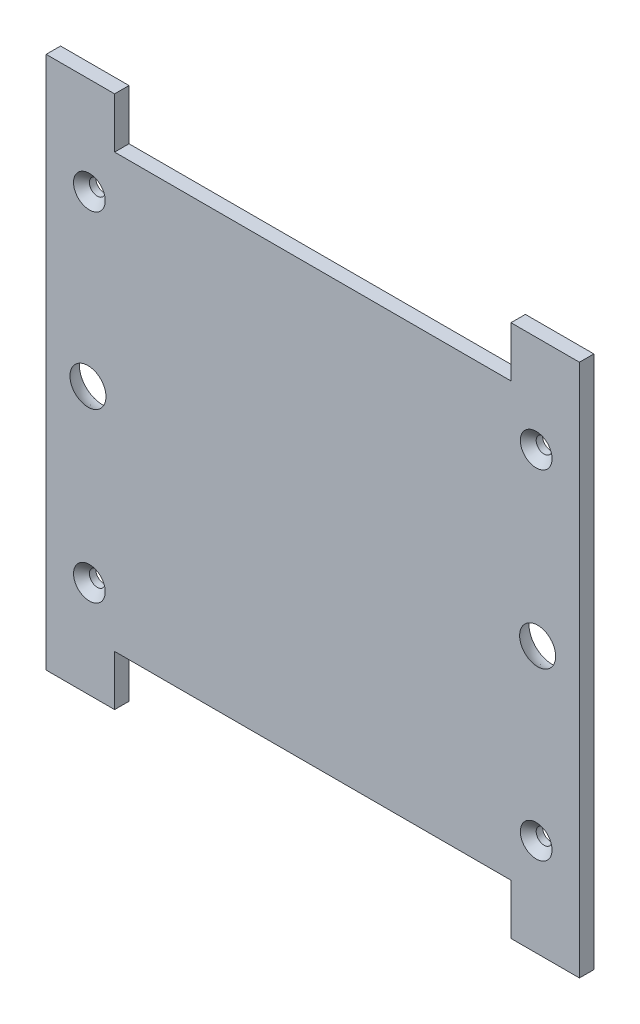
ISO-10303-21;
HEADER;
FILE_DESCRIPTION(('STEP AP214'),'2;1');
FILE_NAME('part.step','',(''),(''),'','','');
FILE_SCHEMA(('AUTOMOTIVE_DESIGN { 1 0 10303 214 1 1 1 1 }'));
ENDSEC;
DATA;
#1=APPLICATION_CONTEXT('core data for automotive mechanical design processes');
#2=APPLICATION_PROTOCOL_DEFINITION('international standard','automotive_design',2000,#1);
#3=PRODUCT_CONTEXT('',#1,'mechanical');
#4=PRODUCT('Part','Part','',(#3));
#5=PRODUCT_RELATED_PRODUCT_CATEGORY('part','',(#4));
#6=PRODUCT_DEFINITION_FORMATION('','',#4);
#7=PRODUCT_DEFINITION_CONTEXT('part definition',#1,'design');
#8=PRODUCT_DEFINITION('design','',#6,#7);
#9=PRODUCT_DEFINITION_SHAPE('','',#8);
#10=(LENGTH_UNIT() NAMED_UNIT(*) SI_UNIT(.MILLI.,.METRE.));
#11=(NAMED_UNIT(*) PLANE_ANGLE_UNIT() SI_UNIT($,.RADIAN.));
#12=(NAMED_UNIT(*) SI_UNIT($,.STERADIAN.) SOLID_ANGLE_UNIT());
#13=UNCERTAINTY_MEASURE_WITH_UNIT(LENGTH_MEASURE(1.E-05),#10,'distance_accuracy_value','');
#14=(GEOMETRIC_REPRESENTATION_CONTEXT(3) GLOBAL_UNCERTAINTY_ASSIGNED_CONTEXT((#13)) GLOBAL_UNIT_ASSIGNED_CONTEXT((#10,
#11,#12)) REPRESENTATION_CONTEXT('',''));
#15=CARTESIAN_POINT('',(0.,0.,0.));
#16=DIRECTION('',(0.,0.,1.));
#17=DIRECTION('',(1.,0.,0.));
#18=AXIS2_PLACEMENT_3D('',#15,#16,#17);
#19=CARTESIAN_POINT('',(0.,37.,0.));
#20=DIRECTION('',(0.,-1.,0.));
#21=DIRECTION('',(0.,0.,-1.));
#22=AXIS2_PLACEMENT_3D('',#19,#20,#21);
#23=PLANE('',#22);
#24=DIRECTION('',(-1.,0.,0.));
#25=VECTOR('',#24,1.);
#26=CARTESIAN_POINT('',(-37.,37.,0.));
#27=LINE('',#26,#25);
#28=CARTESIAN_POINT('',(37.,37.,0.));
#29=VERTEX_POINT('',#28);
#30=CARTESIAN_POINT('',(27.500000007,37.,0.));
#31=VERTEX_POINT('',#30);
#32=EDGE_CURVE('E165',#29,#31,#27,.T.);
#33=ORIENTED_EDGE('',*,*,#32,.T.);
#34=DIRECTION('',(0.,0.,1.));
#35=VECTOR('',#34,1.);
#36=CARTESIAN_POINT('',(27.500000007,37.,0.));
#37=LINE('',#36,#35);
#38=CARTESIAN_POINT('',(27.500000007,37.,2.));
#39=VERTEX_POINT('',#38);
#40=EDGE_CURVE('E148',#31,#39,#37,.T.);
#41=ORIENTED_EDGE('',*,*,#40,.T.);
#42=DIRECTION('',(1.,0.,0.));
#43=VECTOR('',#42,1.);
#44=CARTESIAN_POINT('',(34.4,37.,2.));
#45=LINE('',#44,#43);
#46=CARTESIAN_POINT('',(37.,37.,2.));
#47=VERTEX_POINT('',#46);
#48=EDGE_CURVE('E177',#39,#47,#45,.T.);
#49=ORIENTED_EDGE('',*,*,#48,.T.);
#50=DIRECTION('',(0.,0.,1.));
#51=VECTOR('',#50,1.);
#52=CARTESIAN_POINT('',(37.,37.,2.));
#53=LINE('',#52,#51);
#54=EDGE_CURVE('E172',#29,#47,#53,.T.);
#55=ORIENTED_EDGE('',*,*,#54,.F.);
#56=EDGE_LOOP('',(#33,#41,#49,#55));
#57=FACE_BOUND('',#56,.T.);
#58=ADVANCED_FACE('F42',(#57),#23,.F.);
#59=CARTESIAN_POINT('',(0.,-37.,0.));
#60=DIRECTION('',(0.,1.,0.));
#61=DIRECTION('',(0.,0.,1.));
#62=AXIS2_PLACEMENT_3D('',#59,#60,#61);
#63=PLANE('',#62);
#64=DIRECTION('',(1.,0.,0.));
#65=VECTOR('',#64,1.);
#66=CARTESIAN_POINT('',(34.4,-37.,0.));
#67=LINE('',#66,#65);
#68=CARTESIAN_POINT('',(-37.,-37.,0.));
#69=VERTEX_POINT('',#68);
#70=CARTESIAN_POINT('',(-27.500000007,-37.,0.));
#71=VERTEX_POINT('',#70);
#72=EDGE_CURVE('E179',#69,#71,#67,.T.);
#73=ORIENTED_EDGE('',*,*,#72,.T.);
#74=DIRECTION('',(0.,0.,1.));
#75=VECTOR('',#74,1.);
#76=CARTESIAN_POINT('',(-27.500000007,-37.,0.));
#77=LINE('',#76,#75);
#78=CARTESIAN_POINT('',(-27.500000007,-37.,2.));
#79=VERTEX_POINT('',#78);
#80=EDGE_CURVE('E474',#71,#79,#77,.T.);
#81=ORIENTED_EDGE('',*,*,#80,.T.);
#82=DIRECTION('',(-1.,0.,0.));
#83=VECTOR('',#82,1.);
#84=CARTESIAN_POINT('',(-37.,-37.,2.));
#85=LINE('',#84,#83);
#86=CARTESIAN_POINT('',(-37.,-37.,2.));
#87=VERTEX_POINT('',#86);
#88=EDGE_CURVE('E498',#79,#87,#85,.T.);
#89=ORIENTED_EDGE('',*,*,#88,.T.);
#90=DIRECTION('',(0.,0.,-1.));
#91=VECTOR('',#90,1.);
#92=CARTESIAN_POINT('',(-37.,-37.,0.));
#93=LINE('',#92,#91);
#94=EDGE_CURVE('E501',#87,#69,#93,.T.);
#95=ORIENTED_EDGE('',*,*,#94,.T.);
#96=EDGE_LOOP('',(#73,#81,#89,#95));
#97=FACE_BOUND('',#96,.T.);
#98=ADVANCED_FACE('F420',(#97),#63,.F.);
#99=CARTESIAN_POINT('',(-37.,-37.,0.));
#100=DIRECTION('',(0.,0.,1.));
#101=DIRECTION('',(1.,0.,0.));
#102=AXIS2_PLACEMENT_3D('',#99,#100,#101);
#103=PLANE('',#102);
#104=CARTESIAN_POINT('',(-31.,-23.5,0.));
#105=DIRECTION('',(0.,0.,1.));
#106=DIRECTION('',(1.,0.,0.));
#107=AXIS2_PLACEMENT_3D('',#104,#105,#106);
#108=CIRCLE('',#107,1.09999999999999);
#109=CARTESIAN_POINT('',(-29.9,-23.5,0.));
#110=VERTEX_POINT('',#109);
#111=EDGE_CURVE('E581',#110,#110,#108,.T.);
#112=ORIENTED_EDGE('',*,*,#111,.T.);
#113=EDGE_LOOP('',(#112));
#114=FACE_BOUND('',#113,.T.);
#115=CARTESIAN_POINT('',(31.,-23.5,0.));
#116=DIRECTION('',(0.,0.,1.));
#117=DIRECTION('',(1.,0.,0.));
#118=AXIS2_PLACEMENT_3D('',#115,#116,#117);
#119=CIRCLE('',#118,1.09999999999999);
#120=CARTESIAN_POINT('',(32.1,-23.5,0.));
#121=VERTEX_POINT('',#120);
#122=EDGE_CURVE('E592',#121,#121,#119,.T.);
#123=ORIENTED_EDGE('',*,*,#122,.T.);
#124=EDGE_LOOP('',(#123));
#125=FACE_BOUND('',#124,.T.);
#126=CARTESIAN_POINT('',(31.,23.5,0.));
#127=DIRECTION('',(0.,0.,1.));
#128=DIRECTION('',(1.,0.,0.));
#129=AXIS2_PLACEMENT_3D('',#126,#127,#128);
#130=CIRCLE('',#129,1.09999999999999);
#131=CARTESIAN_POINT('',(32.1,23.5,0.));
#132=VERTEX_POINT('',#131);
#133=EDGE_CURVE('E601',#132,#132,#130,.T.);
#134=ORIENTED_EDGE('',*,*,#133,.T.);
#135=EDGE_LOOP('',(#134));
#136=FACE_BOUND('',#135,.T.);
#137=CARTESIAN_POINT('',(-31.,23.5,0.));
#138=DIRECTION('',(0.,0.,1.));
#139=DIRECTION('',(1.,0.,0.));
#140=AXIS2_PLACEMENT_3D('',#137,#138,#139);
#141=CIRCLE('',#140,1.09999999999999);
#142=CARTESIAN_POINT('',(-29.9,23.5,0.));
#143=VERTEX_POINT('',#142);
#144=EDGE_CURVE('E456',#143,#143,#141,.T.);
#145=ORIENTED_EDGE('',*,*,#144,.T.);
#146=EDGE_LOOP('',(#145));
#147=FACE_BOUND('',#146,.T.);
#148=DIRECTION('',(1.,0.,0.));
#149=VECTOR('',#148,1.);
#150=CARTESIAN_POINT('',(-27.500000007,29.9999999925,0.));
#151=LINE('',#150,#149);
#152=CARTESIAN_POINT('',(-27.500000007,29.9999999925,0.));
#153=VERTEX_POINT('',#152);
#154=CARTESIAN_POINT('',(27.500000007,29.9999999925,0.));
#155=VERTEX_POINT('',#154);
#156=EDGE_CURVE('E159',#153,#155,#151,.T.);
#157=ORIENTED_EDGE('',*,*,#156,.T.);
#158=DIRECTION('',(0.,1.,0.));
#159=VECTOR('',#158,1.);
#160=CARTESIAN_POINT('',(27.500000007,29.9999999925,0.));
#161=LINE('',#160,#159);
#162=EDGE_CURVE('E151',#155,#31,#161,.T.);
#163=ORIENTED_EDGE('',*,*,#162,.T.);
#164=ORIENTED_EDGE('',*,*,#32,.F.);
#165=DIRECTION('',(0.,1.,0.));
#166=VECTOR('',#165,1.);
#167=CARTESIAN_POINT('',(37.,37.,0.));
#168=LINE('',#167,#166);
#169=CARTESIAN_POINT('',(37.,-37.,0.));
#170=VERTEX_POINT('',#169);
#171=EDGE_CURVE('E495',#170,#29,#168,.T.);
#172=ORIENTED_EDGE('',*,*,#171,.F.);
#173=CARTESIAN_POINT('',(27.500000007,-37.,0.));
#174=VERTEX_POINT('',#173);
#175=EDGE_CURVE('E503',#174,#170,#67,.T.);
#176=ORIENTED_EDGE('',*,*,#175,.F.);
#177=DIRECTION('',(0.,1.,0.));
#178=VECTOR('',#177,1.);
#179=CARTESIAN_POINT('',(27.500000007,-37.,0.));
#180=LINE('',#179,#178);
#181=CARTESIAN_POINT('',(27.500000007,-29.9999999925,0.));
#182=VERTEX_POINT('',#181);
#183=EDGE_CURVE('E70',#174,#182,#180,.T.);
#184=ORIENTED_EDGE('',*,*,#183,.T.);
#185=DIRECTION('',(-1.,0.,0.));
#186=VECTOR('',#185,1.);
#187=CARTESIAN_POINT('',(27.500000007,-29.9999999925,0.));
#188=LINE('',#187,#186);
#189=CARTESIAN_POINT('',(-27.500000007,-29.9999999925,0.));
#190=VERTEX_POINT('',#189);
#191=EDGE_CURVE('E471',#182,#190,#188,.T.);
#192=ORIENTED_EDGE('',*,*,#191,.T.);
#193=DIRECTION('',(0.,-1.,0.));
#194=VECTOR('',#193,1.);
#195=CARTESIAN_POINT('',(-27.500000007,-29.9999999925,0.));
#196=LINE('',#195,#194);
#197=EDGE_CURVE('E466',#190,#71,#196,.T.);
#198=ORIENTED_EDGE('',*,*,#197,.T.);
#199=ORIENTED_EDGE('',*,*,#72,.F.);
#200=DIRECTION('',(0.,-1.,0.));
#201=VECTOR('',#200,1.);
#202=CARTESIAN_POINT('',(-37.,-3.2,0.));
#203=LINE('',#202,#201);
#204=CARTESIAN_POINT('',(-37.,37.,0.));
#205=VERTEX_POINT('',#204);
#206=EDGE_CURVE('E186',#205,#69,#203,.T.);
#207=ORIENTED_EDGE('',*,*,#206,.F.);
#208=CARTESIAN_POINT('',(-27.500000007,37.,0.));
#209=VERTEX_POINT('',#208);
#210=EDGE_CURVE('E174',#209,#205,#27,.T.);
#211=ORIENTED_EDGE('',*,*,#210,.F.);
#212=DIRECTION('',(0.,-1.,0.));
#213=VECTOR('',#212,1.);
#214=CARTESIAN_POINT('',(-27.500000007,37.,0.));
#215=LINE('',#214,#213);
#216=EDGE_CURVE('E62',#209,#153,#215,.T.);
#217=ORIENTED_EDGE('',*,*,#216,.T.);
#218=EDGE_LOOP('',(#157,#163,#164,#172,#176,#184,#192,#198,#199,#207,#211,#217));
#219=FACE_BOUND('',#218,.T.);
#220=CARTESIAN_POINT('',(31.2,0.,0.));
#221=DIRECTION('',(0.,0.,1.));
#222=DIRECTION('',(-1.,0.,0.));
#223=AXIS2_PLACEMENT_3D('',#220,#221,#222);
#224=CIRCLE('',#223,3.2);
#225=CARTESIAN_POINT('',(28.,0.,0.));
#226=VERTEX_POINT('',#225);
#227=CARTESIAN_POINT('',(34.4,0.,0.));
#228=VERTEX_POINT('',#227);
#229=EDGE_CURVE('E233',#226,#228,#224,.T.);
#230=ORIENTED_EDGE('',*,*,#229,.T.);
#231=CARTESIAN_POINT('',(31.2,0.,0.));
#232=DIRECTION('',(0.,0.,-1.));
#233=DIRECTION('',(-1.,0.,0.));
#234=AXIS2_PLACEMENT_3D('',#231,#232,#233);
#235=CIRCLE('',#234,3.2);
#236=EDGE_CURVE('E236',#228,#226,#235,.F.);
#237=ORIENTED_EDGE('',*,*,#236,.T.);
#238=EDGE_LOOP('',(#230,#237));
#239=FACE_BOUND('',#238,.T.);
#240=CARTESIAN_POINT('',(-31.2,0.,0.));
#241=DIRECTION('',(0.,0.,1.));
#242=DIRECTION('',(-1.,0.,0.));
#243=AXIS2_PLACEMENT_3D('',#240,#241,#242);
#244=CIRCLE('',#243,3.2);
#245=CARTESIAN_POINT('',(-34.4,0.,0.));
#246=VERTEX_POINT('',#245);
#247=CARTESIAN_POINT('',(-28.,0.,0.));
#248=VERTEX_POINT('',#247);
#249=EDGE_CURVE('E47',#246,#248,#244,.T.);
#250=ORIENTED_EDGE('',*,*,#249,.T.);
#251=CARTESIAN_POINT('',(-31.2,0.,0.));
#252=DIRECTION('',(0.,0.,1.));
#253=DIRECTION('',(-1.,0.,0.));
#254=AXIS2_PLACEMENT_3D('',#251,#252,#253);
#255=CIRCLE('',#254,3.2);
#256=EDGE_CURVE('E237',#248,#246,#255,.T.);
#257=ORIENTED_EDGE('',*,*,#256,.T.);
#258=EDGE_LOOP('',(#250,#257));
#259=FACE_BOUND('',#258,.T.);
#260=ADVANCED_FACE('F162',(#114,#125,#136,#147,#219,#239,#259),#103,.F.);
#261=CARTESIAN_POINT('',(-31.2,0.,0.));
#262=DIRECTION('',(1.,0.,0.));
#263=DIRECTION('',(0.,-1.,0.));
#264=AXIS2_PLACEMENT_3D('',#261,#262,#263);
#265=SPHERICAL_SURFACE('',#264,3.2);
#266=ORIENTED_EDGE('',*,*,#249,.F.);
#267=ORIENTED_EDGE('',*,*,#256,.F.);
#268=EDGE_LOOP('',(#266,#267));
#269=FACE_BOUND('',#268,.T.);
#270=CARTESIAN_POINT('',(-28.7020008006406,-2.0509626842719E-10,2.));
#271=CARTESIAN_POINT('',(-28.7020012209484,-0.070135983993747,2.));
#272=CARTESIAN_POINT('',(-28.7049572392322,-0.140284857163702,2.));
#273=CARTESIAN_POINT('',(-28.7167620940701,-0.280097831874726,2.));
#274=CARTESIAN_POINT('',(-28.7256126703689,-0.349761784158728,2.));
#275=CARTESIAN_POINT('',(-28.7491668221806,-0.488213726424342,2.));
#276=CARTESIAN_POINT('',(-28.7638796886623,-0.557000146175289,2.));
#277=CARTESIAN_POINT('',(-28.7990570025474,-0.693127271670801,2.));
#278=CARTESIAN_POINT('',(-28.8195261173959,-0.760466756275641,2.));
#279=CARTESIAN_POINT('',(-28.8892848378274,-0.959305142461169,2.));
#280=CARTESIAN_POINT('',(-28.9469831180034,-1.08795860462085,2.));
#281=CARTESIAN_POINT('',(-29.0831904020595,-1.33373843161031,2.));
#282=CARTESIAN_POINT('',(-29.1617001970435,-1.45086435801405,2.));
#283=CARTESIAN_POINT('',(-29.293286161117,-1.61536285946238,2.));
#284=CARTESIAN_POINT('',(-29.3394864355108,-1.6683616161924,2.));
#285=CARTESIAN_POINT('',(-29.436151031562,-1.77024220587743,2.));
#286=CARTESIAN_POINT('',(-29.4866111990885,-1.8191279589001,2.));
#287=CARTESIAN_POINT('',(-29.5914945615326,-1.91249617316629,2.));
#288=CARTESIAN_POINT('',(-29.6459195413138,-1.95697662972413,2.));
#289=CARTESIAN_POINT('',(-29.7583182040915,-2.04119901892372,2.));
#290=CARTESIAN_POINT('',(-29.8162927060881,-2.08093985168362,2.));
#291=CARTESIAN_POINT('',(-29.9949083454022,-2.19258284669061,2.));
#292=CARTESIAN_POINT('',(-30.1203524575497,-2.25700399562119,2.00000000000001));
#293=CARTESIAN_POINT('',(-30.3802079569302,-2.36383242870174,1.99999999999999));
#294=CARTESIAN_POINT('',(-30.5146192483722,-2.40623994796758,1.99999999999997));
#295=CARTESIAN_POINT('',(-30.7886710059771,-2.46789871785615,1.99999999999997));
#296=CARTESIAN_POINT('',(-30.9283115000621,-2.48714984481392,1.99999999999999));
#297=CARTESIAN_POINT('',(-31.208842301376,-2.50192941652294,2.00000000000001));
#298=CARTESIAN_POINT('',(-31.349732608605,-2.49745786127418,1.99999999999999));
#299=CARTESIAN_POINT('',(-31.6287461574432,-2.46493695545636,1.99999999999999));
#300=CARTESIAN_POINT('',(-31.7668694138256,-2.43688773080164,2.));
#301=CARTESIAN_POINT('',(-32.0365115847101,-2.35795551714079,2.));
#302=CARTESIAN_POINT('',(-32.1680304286569,-2.30707228425498,1.99999999999999));
#303=CARTESIAN_POINT('',(-32.3573883753691,-2.21481572373656,1.99999999999999));
#304=CARTESIAN_POINT('',(-32.4192177819692,-2.18138667723981,2.));
#305=CARTESIAN_POINT('',(-32.5398440491683,-2.10944104569552,2.));
#306=CARTESIAN_POINT('',(-32.5986416086613,-2.07092564049903,2.));
#307=CARTESIAN_POINT('',(-32.7127551950701,-1.98909512938154,2.));
#308=CARTESIAN_POINT('',(-32.7680727863225,-1.94578220459652,2.));
#309=CARTESIAN_POINT('',(-32.8749075592384,-1.85462283875681,2.));
#310=CARTESIAN_POINT('',(-32.9264210216768,-1.80677206283211,2.));
#311=CARTESIAN_POINT('',(-33.0745635412537,-1.65701086354027,1.99999999999999));
#312=CARTESIAN_POINT('',(-33.1649459501064,-1.54878290636489,2.));
#313=CARTESIAN_POINT('',(-33.3262250014326,-1.318675941698,2.));
#314=CARTESIAN_POINT('',(-33.3971223845622,-1.19679745333226,2.));
#315=CARTESIAN_POINT('',(-33.4873882612442,-1.0063898526332,2.));
#316=CARTESIAN_POINT('',(-33.5148198896085,-0.941573985634305,2.));
#317=CARTESIAN_POINT('',(-33.5641062902884,-0.809896772662918,2.));
#318=CARTESIAN_POINT('',(-33.5859655758969,-0.743037131511001,2.));
#319=CARTESIAN_POINT('',(-33.6239374439416,-0.607826645150295,2.));
#320=CARTESIAN_POINT('',(-33.6400591009175,-0.539478337746316,2.));
#321=CARTESIAN_POINT('',(-33.6664897281663,-0.401679773027809,2.));
#322=CARTESIAN_POINT('',(-33.6768004128691,-0.332229846951155,2.));
#323=CARTESIAN_POINT('',(-33.688776426321,-0.218893566079055,2.));
#324=CARTESIAN_POINT('',(-33.6922338717323,-0.175188670686404,2.));
#325=CARTESIAN_POINT('',(-33.696845389583,-0.0876575282851449,2.));
#326=CARTESIAN_POINT('',(-33.6979994620223,-0.043831281276538,2.));
#327=CARTESIAN_POINT('',(-33.6979987790631,0.070135983583391,2.));
#328=CARTESIAN_POINT('',(-33.6950427607909,0.140284856753735,2.));
#329=CARTESIAN_POINT('',(-33.6832379059759,0.28009783146653,2.));
#330=CARTESIAN_POINT('',(-33.6743873296886,0.349761783751912,2.));
#331=CARTESIAN_POINT('',(-33.6508331778996,0.488213726021429,2.));
#332=CARTESIAN_POINT('',(-33.6361203114292,0.557000145774899,2.));
#333=CARTESIAN_POINT('',(-33.6009429975665,0.693127271276379,2.));
#334=CARTESIAN_POINT('',(-33.580473882729,0.760466755884665,2.));
#335=CARTESIAN_POINT('',(-33.5107151623301,0.959305142081725,2.));
#336=CARTESIAN_POINT('',(-33.4530168821753,1.08795860425088,2.));
#337=CARTESIAN_POINT('',(-33.3168095981596,1.33373843126271,2.));
#338=CARTESIAN_POINT('',(-33.2382998031948,1.45086435767934,2.));
#339=CARTESIAN_POINT('',(-33.1067138391482,1.61536285914927,2.));
#340=CARTESIAN_POINT('',(-33.0605135647632,1.66836161588688,2.));
#341=CARTESIAN_POINT('',(-32.9638489687287,1.77024220558777,2.));
#342=CARTESIAN_POINT('',(-32.9133888012102,1.81912795861872,2.));
#343=CARTESIAN_POINT('',(-32.8085054387815,1.91249617290214,2.));
#344=CARTESIAN_POINT('',(-32.7540804590075,1.95697662946892,2.));
#345=CARTESIAN_POINT('',(-32.6416817962437,2.04119901868698,2.));
#346=CARTESIAN_POINT('',(-32.5837072942536,2.0809398514564,2.));
#347=CARTESIAN_POINT('',(-32.4050916549578,2.19258284649273,2.));
#348=CARTESIAN_POINT('',(-32.2796475428209,2.2570039954439,2.00000000000001));
#349=CARTESIAN_POINT('',(-32.0197920434579,2.36383242856713,1.99999999999999));
#350=CARTESIAN_POINT('',(-31.8853807520229,2.40623994785503,1.99999999999997));
#351=CARTESIAN_POINT('',(-31.6113289944281,2.46789871778861,1.99999999999997));
#352=CARTESIAN_POINT('',(-31.4716885003464,2.48714984476931,1.99999999999999));
#353=CARTESIAN_POINT('',(-31.1911576990348,2.50192941652439,2.00000000000001));
#354=CARTESIAN_POINT('',(-31.0502673918051,2.49745786129877,1.99999999999999));
#355=CARTESIAN_POINT('',(-30.7712538429615,2.46493695552677,1.99999999999999));
#356=CARTESIAN_POINT('',(-30.6331305865746,2.43688773089472,2.));
#357=CARTESIAN_POINT('',(-30.3634884156771,2.35795551727816,2.));
#358=CARTESIAN_POINT('',(-30.2319695717219,2.30707228441393,1.99999999999999));
#359=CARTESIAN_POINT('',(-30.0426116249946,2.21481572392661,2.));
#360=CARTESIAN_POINT('',(-29.980782218389,2.18138667744002,2.));
#361=CARTESIAN_POINT('',(-29.8601559511781,2.10944104591554,2.));
#362=CARTESIAN_POINT('',(-29.8013583916788,2.07092564072871,2.));
#363=CARTESIAN_POINT('',(-29.6872448052565,1.98909512962996,2.));
#364=CARTESIAN_POINT('',(-29.6319272139971,1.94578220485402,2.));
#365=CARTESIAN_POINT('',(-29.5250924410661,1.85462283903184,2.));
#366=CARTESIAN_POINT('',(-29.4735789786198,1.80677206311561,2.));
#367=CARTESIAN_POINT('',(-29.3254364590184,1.6570108638481,1.99999999999999));
#368=CARTESIAN_POINT('',(-29.235054050148,1.54878290668756,2.));
#369=CARTESIAN_POINT('',(-29.0737749987839,1.31867594204715,2.));
#370=CARTESIAN_POINT('',(-29.0028776156344,1.19679745369305,2.));
#371=CARTESIAN_POINT('',(-28.9126117389211,1.00638985300888,2.));
#372=CARTESIAN_POINT('',(-28.8851801105462,0.941573986014578,2.));
#373=CARTESIAN_POINT('',(-28.8358937098447,0.809896773051471,2.));
#374=CARTESIAN_POINT('',(-28.8140344242252,0.743037131903249,2.));
#375=CARTESIAN_POINT('',(-28.7760625561583,0.607826645548818,2.));
#376=CARTESIAN_POINT('',(-28.7599408991712,0.539478338147416,2.));
#377=CARTESIAN_POINT('',(-28.7335102718997,0.401679773433086,2.));
#378=CARTESIAN_POINT('',(-28.7231995871854,0.33222984735803,2.));
#379=CARTESIAN_POINT('',(-28.7112235737005,0.218893566351757,2.));
#380=CARTESIAN_POINT('',(-28.7077661282749,0.175188670822944,2.));
#381=CARTESIAN_POINT('',(-28.7031546104099,0.0876575281486049,2.));
#382=CARTESIAN_POINT('',(-28.7020005379705,0.0438312810030793,2.));
#383=CARTESIAN_POINT('',(-28.7020008006406,-2.0509626842719E-10,2.));
#384=B_SPLINE_CURVE_WITH_KNOTS('',3,(#270,#271,#272,#273,#274,#275,#276,#277,#278,#279,#280,
#281,#282,#283,#284,#285,#286,#287,#288,#289,#290,#291,#292,#293,#294,#295,#296,#297,#298,#299,
#300,#301,#302,#303,#304,#305,#306,#307,#308,#309,#310,#311,#312,#313,#314,#315,#316,#317,#318,
#319,#320,#321,#322,#323,#324,#325,#326,#327,#328,#329,#330,#331,#332,#333,#334,#335,#336,#337,
#338,#339,#340,#341,#342,#343,#344,#345,#346,#347,#348,#349,#350,#351,#352,#353,#354,#355,#356,
#357,#358,#359,#360,#361,#362,#363,#364,#365,#366,#367,#368,#369,#370,#371,#372,#373,#374,#375,
#376,#377,#378,#379,#380,#381,#382,#383),.UNSPECIFIED.,.T.,.F.,(4,2,2,2,2,2,2,2,2,2,2,2,2,2,2,2,
2,2,2,2,2,2,2,2,2,2,2,2,2,2,2,2,2,2,2,2,2,2,2,2,2,2,2,2,2,2,2,2,2,2,2,2,2,2,2,2,4),(0.,
0.210367600517301,0.420797317340917,0.631561873011383,0.842497822016848,1.26336421327966,
1.68424660514718,1.89496355766447,2.1054773473023,2.3160864979215,2.52674442800266,
2.94762106719418,3.36849321113397,3.78936760269969,4.21024199426541,4.63111413820522,
5.05199077739674,5.26264870747792,5.47325785809713,5.68377164773495,5.89448860025222,
6.31537099211975,6.73623738338256,6.94717333238829,7.15793788805906,7.36836760488248,
7.57873520539941,7.71020383146715,7.8416724575349,8.05204005805182,8.26246977487524,
8.47323433054602,8.68417027955175,9.10503667081454,9.52591906268207,9.73663601519935,
9.94714980483716,10.1577589554564,10.3684168855376,10.7892935247291,11.2101656686689,
11.6310400602346,12.0519144518003,12.4727865957401,12.8936632349316,13.1043211650128,
13.314930315632,13.5254441052698,13.7361610577871,14.1570434496546,14.5779098409175,
14.7888457899229,14.9996103455934,15.210040062417,15.4204076629343,15.5518762894121,
15.6833449158899),.UNSPECIFIED.);
#385=CARTESIAN_POINT('',(-28.7020008006406,-2.0509626842719E-10,2.));
#386=VERTEX_POINT('',#385);
#387=EDGE_CURVE('E54',#386,#386,#384,.T.);
#388=ORIENTED_EDGE('',*,*,#387,.F.);
#389=EDGE_LOOP('',(#388));
#390=FACE_BOUND('',#389,.T.);
#391=ADVANCED_FACE('F199',(#269,#390),#265,.F.);
#392=CARTESIAN_POINT('',(31.2,0.,0.));
#393=DIRECTION('',(1.,0.,0.));
#394=DIRECTION('',(0.,1.,0.));
#395=AXIS2_PLACEMENT_3D('',#392,#393,#394);
#396=SPHERICAL_SURFACE('',#395,3.2);
#397=ORIENTED_EDGE('',*,*,#229,.F.);
#398=ORIENTED_EDGE('',*,*,#236,.F.);
#399=EDGE_LOOP('',(#397,#398));
#400=FACE_BOUND('',#399,.T.);
#401=CARTESIAN_POINT('',(33.6979991993594,3.84690109628272E-10,2.));
#402=CARTESIAN_POINT('',(33.6979987790681,-0.070135983403726,2.));
#403=CARTESIAN_POINT('',(33.695042760801,-0.140284856574241,2.));
#404=CARTESIAN_POINT('',(33.6832379059961,-0.28009783128781,2.));
#405=CARTESIAN_POINT('',(33.6743873297138,-0.349761783573797,2.));
#406=CARTESIAN_POINT('',(33.6508331779348,-0.488213725845023,2.));
#407=CARTESIAN_POINT('',(33.6361203114693,-0.557000145599597,2.));
#408=CARTESIAN_POINT('',(33.6009429976163,-0.693127271103689,2.));
#409=CARTESIAN_POINT('',(33.5804738827837,-0.760466755713485,2.));
#410=CARTESIAN_POINT('',(33.5107151623991,-0.959305141915595,2.));
#411=CARTESIAN_POINT('',(33.4530168822535,-1.08795860408889,2.));
#412=CARTESIAN_POINT('',(33.3168095982554,-1.33373843111052,2.));
#413=CARTESIAN_POINT('',(33.2382998032991,-1.4508643575328,2.));
#414=CARTESIAN_POINT('',(33.1067138392644,-1.61536285901219,2.));
#415=CARTESIAN_POINT('',(33.0605135648831,-1.66836161575312,2.));
#416=CARTESIAN_POINT('',(32.963848968856,-1.77024220546095,2.));
#417=CARTESIAN_POINT('',(32.913388801341,-1.81912795849554,2.));
#418=CARTESIAN_POINT('',(32.808505438919,-1.91249617278649,2.));
#419=CARTESIAN_POINT('',(32.7540804591482,-1.95697662935719,2.));
#420=CARTESIAN_POINT('',(32.6416817963905,-2.04119901858333,2.));
#421=CARTESIAN_POINT('',(32.5837072944032,-2.08093985135692,2.));
#422=CARTESIAN_POINT('',(32.4050916551154,-2.19258284640609,2.));
#423=CARTESIAN_POINT('',(32.2796475429831,-2.25700399536628,2.00000000000001));
#424=CARTESIAN_POINT('',(32.0197920436279,-2.36383242850819,1.99999999999999));
#425=CARTESIAN_POINT('',(31.8853807521959,-2.40623994780576,1.99999999999997));
#426=CARTESIAN_POINT('',(31.6113289946056,-2.46789871775903,1.99999999999997));
#427=CARTESIAN_POINT('',(31.4716885005252,-2.48714984474977,1.99999999999999));
#428=CARTESIAN_POINT('',(31.1911576992147,-2.50192941652502,2.00000000000001));
#429=CARTESIAN_POINT('',(31.0502673919846,-2.49745786130953,2.));
#430=CARTESIAN_POINT('',(30.7712538431388,-2.46493695555759,1.99999999999999));
#431=CARTESIAN_POINT('',(30.6331305867498,-2.43688773093548,2.));
#432=CARTESIAN_POINT('',(30.3634884158466,-2.3579555173383,2.));
#433=CARTESIAN_POINT('',(30.2319695718878,-2.30707228448353,1.99999999999999));
#434=CARTESIAN_POINT('',(30.0426116251539,-2.21481572400982,2.));
#435=CARTESIAN_POINT('',(29.9807822185458,-2.18138667752768,2.));
#436=CARTESIAN_POINT('',(29.8601559513298,-2.10944104601187,2.));
#437=CARTESIAN_POINT('',(29.8013583918277,-2.07092564082927,2.));
#438=CARTESIAN_POINT('',(29.6872448053995,-1.98909512973873,2.));
#439=CARTESIAN_POINT('',(29.631927214137,-1.94578220496676,2.));
#440=CARTESIAN_POINT('',(29.5250924411994,-1.85462283915226,2.));
#441=CARTESIAN_POINT('',(29.4735789787497,-1.80677206323973,2.));
#442=CARTESIAN_POINT('',(29.3254364591375,-1.65701086398287,1.99999999999999));
#443=CARTESIAN_POINT('',(29.2350540502593,-1.54878290682883,2.));
#444=CARTESIAN_POINT('',(29.0737749988787,-1.31867594220002,2.));
#445=CARTESIAN_POINT('',(29.0028776157204,-1.19679745385101,2.));
#446=CARTESIAN_POINT('',(28.9126117389935,-1.00638985317337,2.));
#447=CARTESIAN_POINT('',(28.8851801106139,-0.941573986181073,2.));
#448=CARTESIAN_POINT('',(28.835893709903,-0.809896773221591,2.));
#449=CARTESIAN_POINT('',(28.8140344242787,-0.743037132074985,2.));
#450=CARTESIAN_POINT('',(28.7760625562021,-0.607826645723302,2.));
#451=CARTESIAN_POINT('',(28.75994089921,-0.539478338323029,2.));
#452=CARTESIAN_POINT('',(28.7335102719286,-0.401679773610527,2.));
#453=CARTESIAN_POINT('',(28.7231995872093,-0.332229847536171,2.));
#454=CARTESIAN_POINT('',(28.71122357371,-0.218893566471153,2.));
#455=CARTESIAN_POINT('',(28.707766128278,-0.175188670882725,2.));
#456=CARTESIAN_POINT('',(28.7031546104067,-0.0876575280888241,2.));
#457=CARTESIAN_POINT('',(28.7020005379673,-0.0438312808833515,2.));
#458=CARTESIAN_POINT('',(28.7020012209535,0.0701359841734129,2.));
#459=CARTESIAN_POINT('',(28.7049572392423,0.140284857343197,2.));
#460=CARTESIAN_POINT('',(28.7167620940903,0.280097832053447,2.));
#461=CARTESIAN_POINT('',(28.7256126703941,0.349761784336844,2.));
#462=CARTESIAN_POINT('',(28.7491668222158,0.488213726600749,2.));
#463=CARTESIAN_POINT('',(28.7638796887024,0.557000146350592,2.));
#464=CARTESIAN_POINT('',(28.7990570025973,0.693127271843492,2.));
#465=CARTESIAN_POINT('',(28.8195261174506,0.760466756446823,2.));
#466=CARTESIAN_POINT('',(28.8892848378964,0.959305142627301,2.));
#467=CARTESIAN_POINT('',(28.9469831180816,1.08795860478284,2.));
#468=CARTESIAN_POINT('',(29.0831904021553,1.33373843176251,2.));
#469=CARTESIAN_POINT('',(29.1617001971478,1.45086435816059,2.));
#470=CARTESIAN_POINT('',(29.2932861612332,1.61536285959946,2.));
#471=CARTESIAN_POINT('',(29.3394864356308,1.66836161632617,2.));
#472=CARTESIAN_POINT('',(29.4361510316893,1.77024220600425,2.));
#473=CARTESIAN_POINT('',(29.4866111992193,1.81912795902329,2.));
#474=CARTESIAN_POINT('',(29.5914945616701,1.91249617328194,2.));
#475=CARTESIAN_POINT('',(29.6459195414545,1.95697662983587,2.));
#476=CARTESIAN_POINT('',(29.7583182042382,2.04119901902737,2.));
#477=CARTESIAN_POINT('',(29.8162927062377,2.08093985178311,2.));
#478=CARTESIAN_POINT('',(29.9949083455599,2.19258284677725,2.));
#479=CARTESIAN_POINT('',(30.120352457712,2.25700399569881,2.00000000000001));
#480=CARTESIAN_POINT('',(30.3802079571002,2.36383242876068,1.99999999999999));
#481=CARTESIAN_POINT('',(30.5146192485452,2.40623994801685,1.99999999999997));
#482=CARTESIAN_POINT('',(30.7886710061545,2.46789871788572,1.99999999999997));
#483=CARTESIAN_POINT('',(30.9283115002409,2.48714984483345,1.99999999999999));
#484=CARTESIAN_POINT('',(31.2088423015559,2.5019294165223,2.00000000000001));
#485=CARTESIAN_POINT('',(31.3497326087846,2.49745786126341,1.99999999999999));
#486=CARTESIAN_POINT('',(31.6287461576204,2.46493695542554,1.99999999999999));
#487=CARTESIAN_POINT('',(31.7668694140007,2.43688773076088,2.));
#488=CARTESIAN_POINT('',(32.0365115848796,2.35795551708065,2.));
#489=CARTESIAN_POINT('',(32.1680304288228,2.30707228418538,1.99999999999999));
#490=CARTESIAN_POINT('',(32.3573883755283,2.21481572365334,2.));
#491=CARTESIAN_POINT('',(32.419217782126,2.18138667715215,2.));
#492=CARTESIAN_POINT('',(32.5398440493199,2.10944104559918,2.));
#493=CARTESIAN_POINT('',(32.5986416088102,2.07092564039847,2.));
#494=CARTESIAN_POINT('',(32.7127551952131,1.98909512927277,2.));
#495=CARTESIAN_POINT('',(32.7680727864624,1.94578220448377,2.));
#496=CARTESIAN_POINT('',(32.8749075593718,1.85462283863638,2.));
#497=CARTESIAN_POINT('',(32.9264210218067,1.80677206270799,2.));
#498=CARTESIAN_POINT('',(33.0745635413728,1.6570108634055,1.99999999999999));
#499=CARTESIAN_POINT('',(33.1649459502177,1.54878290622362,2.));
#500=CARTESIAN_POINT('',(33.3262250015274,1.31867594154513,2.));
#501=CARTESIAN_POINT('',(33.3971223846482,1.19679745317429,2.));
#502=CARTESIAN_POINT('',(33.4873882613165,1.00638985246871,2.));
#503=CARTESIAN_POINT('',(33.5148198896763,0.941573985467811,2.));
#504=CARTESIAN_POINT('',(33.5641062903467,0.809896772492797,2.));
#505=CARTESIAN_POINT('',(33.5859655759504,0.743037131339261,2.));
#506=CARTESIAN_POINT('',(33.6239374439854,0.607826644975808,2.));
#507=CARTESIAN_POINT('',(33.6400591009563,0.539478337570702,2.));
#508=CARTESIAN_POINT('',(33.6664897281952,0.401679772850367,2.));
#509=CARTESIAN_POINT('',(33.676800412893,0.332229846773011,2.));
#510=CARTESIAN_POINT('',(33.6887764263305,0.218893565959657,2.));
#511=CARTESIAN_POINT('',(33.6922338717355,0.175188670626621,2.));
#512=CARTESIAN_POINT('',(33.6968453895798,0.0876575283449247,2.));
#513=CARTESIAN_POINT('',(33.6979994620192,0.0438312813962649,2.));
#514=CARTESIAN_POINT('',(33.6979991993594,3.84690109628272E-10,2.));
#515=B_SPLINE_CURVE_WITH_KNOTS('',3,(#401,#402,#403,#404,#405,#406,#407,#408,#409,#410,#411,
#412,#413,#414,#415,#416,#417,#418,#419,#420,#421,#422,#423,#424,#425,#426,#427,#428,#429,#430,
#431,#432,#433,#434,#435,#436,#437,#438,#439,#440,#441,#442,#443,#444,#445,#446,#447,#448,#449,
#450,#451,#452,#453,#454,#455,#456,#457,#458,#459,#460,#461,#462,#463,#464,#465,#466,#467,#468,
#469,#470,#471,#472,#473,#474,#475,#476,#477,#478,#479,#480,#481,#482,#483,#484,#485,#486,#487,
#488,#489,#490,#491,#492,#493,#494,#495,#496,#497,#498,#499,#500,#501,#502,#503,#504,#505,#506,
#507,#508,#509,#510,#511,#512,#513,#514),.UNSPECIFIED.,.T.,.F.,(4,2,2,2,2,2,2,2,2,2,2,2,2,2,2,2,
2,2,2,2,2,2,2,2,2,2,2,2,2,2,2,2,2,2,2,2,2,2,2,2,2,2,2,2,2,2,2,2,2,2,2,2,2,2,2,2,4),(0.,
0.210367600516765,0.420797317340091,0.631561873011003,0.84249782201685,1.26336421327964,
1.68424660514718,1.89496355766445,2.10547734730225,2.31608649792147,2.52674442800266,
2.9476210671942,3.36849321113398,3.78936760269969,4.21024199426541,4.63111413820522,
5.05199077739674,5.2626487074779,5.47325785809709,5.68377164773493,5.89448860025223,
6.31537099211974,6.73623738338255,6.9471733323879,7.15793788805823,7.36836760488194,
7.5787352053994,7.71020383205673,7.84167245871406,8.05204005923152,8.26246977605523,
8.47323433172556,8.68417028073091,9.10503667199373,9.52591906386124,9.73663601637853,
9.94714980601637,10.1577589566356,10.3684168867167,10.7892935259082,11.210165669848,
11.6310400614138,12.0519144529795,12.4727865969193,12.8936632361108,13.104321166192,
13.3149303168112,13.525444106449,13.7361610589663,14.1570434508338,14.5779098420966,
14.7888457911025,14.9996103467734,15.2100400635967,15.4204076641135,15.5518762900017,
15.6833449158899),.UNSPECIFIED.);
#516=CARTESIAN_POINT('',(33.6979991993594,3.84690109628272E-10,2.));
#517=VERTEX_POINT('',#516);
#518=EDGE_CURVE('E12',#517,#517,#515,.T.);
#519=ORIENTED_EDGE('',*,*,#518,.F.);
#520=EDGE_LOOP('',(#519));
#521=FACE_BOUND('',#520,.T.);
#522=ADVANCED_FACE('F194',(#400,#521),#396,.F.);
#523=CARTESIAN_POINT('',(-37.,-37.,2.));
#524=DIRECTION('',(0.,0.,1.));
#525=DIRECTION('',(1.,0.,0.));
#526=AXIS2_PLACEMENT_3D('',#523,#524,#525);
#527=PLANE('',#526);
#528=CARTESIAN_POINT('',(-31.,-23.5,2.));
#529=DIRECTION('',(0.,0.,1.));
#530=DIRECTION('',(1.,0.,0.));
#531=AXIS2_PLACEMENT_3D('',#528,#529,#530);
#532=CIRCLE('',#531,2.2);
#533=CARTESIAN_POINT('',(-28.8,-23.5,2.));
#534=VERTEX_POINT('',#533);
#535=EDGE_CURVE('E579',#534,#534,#532,.T.);
#536=ORIENTED_EDGE('',*,*,#535,.F.);
#537=EDGE_LOOP('',(#536));
#538=FACE_BOUND('',#537,.T.);
#539=CARTESIAN_POINT('',(31.,-23.5,2.));
#540=DIRECTION('',(0.,0.,1.));
#541=DIRECTION('',(1.,0.,0.));
#542=AXIS2_PLACEMENT_3D('',#539,#540,#541);
#543=CIRCLE('',#542,2.2);
#544=CARTESIAN_POINT('',(33.2,-23.5,2.));
#545=VERTEX_POINT('',#544);
#546=EDGE_CURVE('E586',#545,#545,#543,.T.);
#547=ORIENTED_EDGE('',*,*,#546,.F.);
#548=EDGE_LOOP('',(#547));
#549=FACE_BOUND('',#548,.T.);
#550=CARTESIAN_POINT('',(31.,23.5,2.));
#551=DIRECTION('',(0.,0.,1.));
#552=DIRECTION('',(1.,0.,0.));
#553=AXIS2_PLACEMENT_3D('',#550,#551,#552);
#554=CIRCLE('',#553,2.2);
#555=CARTESIAN_POINT('',(33.2,23.5,2.));
#556=VERTEX_POINT('',#555);
#557=EDGE_CURVE('E595',#556,#556,#554,.T.);
#558=ORIENTED_EDGE('',*,*,#557,.F.);
#559=EDGE_LOOP('',(#558));
#560=FACE_BOUND('',#559,.T.);
#561=CARTESIAN_POINT('',(-31.,23.5,2.));
#562=DIRECTION('',(0.,0.,1.));
#563=DIRECTION('',(1.,0.,0.));
#564=AXIS2_PLACEMENT_3D('',#561,#562,#563);
#565=CIRCLE('',#564,2.2);
#566=CARTESIAN_POINT('',(-28.8,23.5,2.));
#567=VERTEX_POINT('',#566);
#568=EDGE_CURVE('E604',#567,#567,#565,.T.);
#569=ORIENTED_EDGE('',*,*,#568,.F.);
#570=EDGE_LOOP('',(#569));
#571=FACE_BOUND('',#570,.T.);
#572=DIRECTION('',(0.,1.,0.));
#573=VECTOR('',#572,1.);
#574=CARTESIAN_POINT('',(27.500000007,29.9999999925,2.));
#575=LINE('',#574,#573);
#576=CARTESIAN_POINT('',(27.500000007,29.9999999925,2.));
#577=VERTEX_POINT('',#576);
#578=EDGE_CURVE('E154',#577,#39,#575,.T.);
#579=ORIENTED_EDGE('',*,*,#578,.F.);
#580=DIRECTION('',(1.,0.,0.));
#581=VECTOR('',#580,1.);
#582=CARTESIAN_POINT('',(-27.500000007,29.9999999925,2.));
#583=LINE('',#582,#581);
#584=CARTESIAN_POINT('',(-27.500000007,29.9999999925,2.));
#585=VERTEX_POINT('',#584);
#586=EDGE_CURVE('E168',#585,#577,#583,.T.);
#587=ORIENTED_EDGE('',*,*,#586,.F.);
#588=DIRECTION('',(0.,-1.,0.));
#589=VECTOR('',#588,1.);
#590=CARTESIAN_POINT('',(-27.500000007,37.,2.));
#591=LINE('',#590,#589);
#592=CARTESIAN_POINT('',(-27.500000007,37.,2.));
#593=VERTEX_POINT('',#592);
#594=EDGE_CURVE('E452',#593,#585,#591,.T.);
#595=ORIENTED_EDGE('',*,*,#594,.F.);
#596=CARTESIAN_POINT('',(-37.,37.,2.));
#597=VERTEX_POINT('',#596);
#598=EDGE_CURVE('E183',#597,#593,#45,.T.);
#599=ORIENTED_EDGE('',*,*,#598,.F.);
#600=DIRECTION('',(0.,1.,0.));
#601=VECTOR('',#600,1.);
#602=CARTESIAN_POINT('',(-37.,3.2,2.));
#603=LINE('',#602,#601);
#604=EDGE_CURVE('E188',#87,#597,#603,.T.);
#605=ORIENTED_EDGE('',*,*,#604,.F.);
#606=ORIENTED_EDGE('',*,*,#88,.F.);
#607=DIRECTION('',(0.,-1.,0.));
#608=VECTOR('',#607,1.);
#609=CARTESIAN_POINT('',(-27.500000007,-29.9999999925,2.));
#610=LINE('',#609,#608);
#611=CARTESIAN_POINT('',(-27.500000007,-29.9999999925,2.));
#612=VERTEX_POINT('',#611);
#613=EDGE_CURVE('E462',#612,#79,#610,.T.);
#614=ORIENTED_EDGE('',*,*,#613,.F.);
#615=DIRECTION('',(-1.,0.,0.));
#616=VECTOR('',#615,1.);
#617=CARTESIAN_POINT('',(27.500000007,-29.9999999925,2.));
#618=LINE('',#617,#616);
#619=CARTESIAN_POINT('',(27.500000007,-29.9999999925,2.));
#620=VERTEX_POINT('',#619);
#621=EDGE_CURVE('E469',#620,#612,#618,.T.);
#622=ORIENTED_EDGE('',*,*,#621,.F.);
#623=DIRECTION('',(0.,1.,0.));
#624=VECTOR('',#623,1.);
#625=CARTESIAN_POINT('',(27.500000007,-37.,2.));
#626=LINE('',#625,#624);
#627=CARTESIAN_POINT('',(27.500000007,-37.,2.));
#628=VERTEX_POINT('',#627);
#629=EDGE_CURVE('E476',#628,#620,#626,.T.);
#630=ORIENTED_EDGE('',*,*,#629,.F.);
#631=CARTESIAN_POINT('',(37.,-37.,2.));
#632=VERTEX_POINT('',#631);
#633=EDGE_CURVE('E499',#632,#628,#85,.T.);
#634=ORIENTED_EDGE('',*,*,#633,.F.);
#635=DIRECTION('',(0.,-1.,0.));
#636=VECTOR('',#635,1.);
#637=CARTESIAN_POINT('',(37.,-37.,2.));
#638=LINE('',#637,#636);
#639=EDGE_CURVE('E483',#47,#632,#638,.T.);
#640=ORIENTED_EDGE('',*,*,#639,.F.);
#641=ORIENTED_EDGE('',*,*,#48,.F.);
#642=EDGE_LOOP('',(#579,#587,#595,#599,#605,#606,#614,#622,#630,#634,#640,#641));
#643=FACE_BOUND('',#642,.T.);
#644=ORIENTED_EDGE('',*,*,#518,.T.);
#645=EDGE_LOOP('',(#644));
#646=FACE_BOUND('',#645,.T.);
#647=ORIENTED_EDGE('',*,*,#387,.T.);
#648=EDGE_LOOP('',(#647));
#649=FACE_BOUND('',#648,.T.);
#650=ADVANCED_FACE('F44',(#538,#549,#560,#571,#643,#646,#649),#527,.T.);
#651=CARTESIAN_POINT('',(-37.,0.,0.));
#652=DIRECTION('',(1.,0.,0.));
#653=DIRECTION('',(0.,0.,-1.));
#654=AXIS2_PLACEMENT_3D('',#651,#652,#653);
#655=PLANE('',#654);
#656=ORIENTED_EDGE('',*,*,#604,.T.);
#657=DIRECTION('',(0.,0.,1.));
#658=VECTOR('',#657,1.);
#659=CARTESIAN_POINT('',(-37.,37.,2.));
#660=LINE('',#659,#658);
#661=EDGE_CURVE('E173',#205,#597,#660,.T.);
#662=ORIENTED_EDGE('',*,*,#661,.F.);
#663=ORIENTED_EDGE('',*,*,#206,.T.);
#664=ORIENTED_EDGE('',*,*,#94,.F.);
#665=EDGE_LOOP('',(#656,#662,#663,#664));
#666=FACE_BOUND('',#665,.T.);
#667=ADVANCED_FACE('F201',(#666),#655,.F.);
#668=ORIENTED_EDGE('',*,*,#598,.T.);
#669=DIRECTION('',(0.,0.,1.));
#670=VECTOR('',#669,1.);
#671=CARTESIAN_POINT('',(-27.500000007,37.,0.));
#672=LINE('',#671,#670);
#673=EDGE_CURVE('E158',#209,#593,#672,.T.);
#674=ORIENTED_EDGE('',*,*,#673,.F.);
#675=ORIENTED_EDGE('',*,*,#210,.T.);
#676=ORIENTED_EDGE('',*,*,#661,.T.);
#677=EDGE_LOOP('',(#668,#674,#675,#676));
#678=FACE_BOUND('',#677,.T.);
#679=ADVANCED_FACE('F424',(#678),#23,.F.);
#680=ORIENTED_EDGE('',*,*,#633,.T.);
#681=DIRECTION('',(0.,0.,1.));
#682=VECTOR('',#681,1.);
#683=CARTESIAN_POINT('',(27.500000007,-37.,0.));
#684=LINE('',#683,#682);
#685=EDGE_CURVE('E486',#174,#628,#684,.T.);
#686=ORIENTED_EDGE('',*,*,#685,.F.);
#687=ORIENTED_EDGE('',*,*,#175,.T.);
#688=DIRECTION('',(0.,0.,-1.));
#689=VECTOR('',#688,1.);
#690=CARTESIAN_POINT('',(37.,-37.,0.));
#691=LINE('',#690,#689);
#692=EDGE_CURVE('E492',#632,#170,#691,.T.);
#693=ORIENTED_EDGE('',*,*,#692,.F.);
#694=EDGE_LOOP('',(#680,#686,#687,#693));
#695=FACE_BOUND('',#694,.T.);
#696=ADVANCED_FACE('F431',(#695),#63,.F.);
#697=CARTESIAN_POINT('',(37.,0.,0.));
#698=DIRECTION('',(-1.,0.,0.));
#699=DIRECTION('',(0.,0.,1.));
#700=AXIS2_PLACEMENT_3D('',#697,#698,#699);
#701=PLANE('',#700);
#702=ORIENTED_EDGE('',*,*,#639,.T.);
#703=ORIENTED_EDGE('',*,*,#692,.T.);
#704=ORIENTED_EDGE('',*,*,#171,.T.);
#705=ORIENTED_EDGE('',*,*,#54,.T.);
#706=EDGE_LOOP('',(#702,#703,#704,#705));
#707=FACE_BOUND('',#706,.T.);
#708=ADVANCED_FACE('F440',(#707),#701,.F.);
#709=CARTESIAN_POINT('',(-27.500000007,-29.9999999925,0.));
#710=DIRECTION('',(-1.,0.,0.));
#711=DIRECTION('',(0.,0.,1.));
#712=AXIS2_PLACEMENT_3D('',#709,#710,#711);
#713=PLANE('',#712);
#714=ORIENTED_EDGE('',*,*,#613,.T.);
#715=ORIENTED_EDGE('',*,*,#80,.F.);
#716=ORIENTED_EDGE('',*,*,#197,.F.);
#717=DIRECTION('',(0.,0.,1.));
#718=VECTOR('',#717,1.);
#719=CARTESIAN_POINT('',(-27.500000007,-29.9999999925,0.));
#720=LINE('',#719,#718);
#721=EDGE_CURVE('E481',#190,#612,#720,.T.);
#722=ORIENTED_EDGE('',*,*,#721,.T.);
#723=EDGE_LOOP('',(#714,#715,#716,#722));
#724=FACE_BOUND('',#723,.T.);
#725=ADVANCED_FACE('F512',(#724),#713,.F.);
#726=CARTESIAN_POINT('',(27.500000007,-29.9999999925,0.));
#727=DIRECTION('',(0.,1.,0.));
#728=DIRECTION('',(0.,0.,1.));
#729=AXIS2_PLACEMENT_3D('',#726,#727,#728);
#730=PLANE('',#729);
#731=ORIENTED_EDGE('',*,*,#621,.T.);
#732=ORIENTED_EDGE('',*,*,#721,.F.);
#733=ORIENTED_EDGE('',*,*,#191,.F.);
#734=DIRECTION('',(0.,0.,1.));
#735=VECTOR('',#734,1.);
#736=CARTESIAN_POINT('',(27.500000007,-29.9999999925,0.));
#737=LINE('',#736,#735);
#738=EDGE_CURVE('E484',#182,#620,#737,.T.);
#739=ORIENTED_EDGE('',*,*,#738,.T.);
#740=EDGE_LOOP('',(#731,#732,#733,#739));
#741=FACE_BOUND('',#740,.T.);
#742=ADVANCED_FACE('F517',(#741),#730,.F.);
#743=CARTESIAN_POINT('',(27.500000007,-37.,0.));
#744=DIRECTION('',(1.,0.,0.));
#745=DIRECTION('',(0.,0.,-1.));
#746=AXIS2_PLACEMENT_3D('',#743,#744,#745);
#747=PLANE('',#746);
#748=ORIENTED_EDGE('',*,*,#629,.T.);
#749=ORIENTED_EDGE('',*,*,#738,.F.);
#750=ORIENTED_EDGE('',*,*,#183,.F.);
#751=ORIENTED_EDGE('',*,*,#685,.T.);
#752=EDGE_LOOP('',(#748,#749,#750,#751));
#753=FACE_BOUND('',#752,.T.);
#754=ADVANCED_FACE('F518',(#753),#747,.F.);
#755=CARTESIAN_POINT('',(27.500000007,29.9999999925,0.));
#756=DIRECTION('',(1.,0.,0.));
#757=DIRECTION('',(0.,0.,-1.));
#758=AXIS2_PLACEMENT_3D('',#755,#756,#757);
#759=PLANE('',#758);
#760=ORIENTED_EDGE('',*,*,#578,.T.);
#761=ORIENTED_EDGE('',*,*,#40,.F.);
#762=ORIENTED_EDGE('',*,*,#162,.F.);
#763=DIRECTION('',(0.,0.,1.));
#764=VECTOR('',#763,1.);
#765=CARTESIAN_POINT('',(27.500000007,29.9999999925,0.));
#766=LINE('',#765,#764);
#767=EDGE_CURVE('E460',#155,#577,#766,.T.);
#768=ORIENTED_EDGE('',*,*,#767,.T.);
#769=EDGE_LOOP('',(#760,#761,#762,#768));
#770=FACE_BOUND('',#769,.T.);
#771=ADVANCED_FACE('F150',(#770),#759,.F.);
#772=CARTESIAN_POINT('',(-27.500000007,29.9999999925,0.));
#773=DIRECTION('',(0.,-1.,0.));
#774=DIRECTION('',(0.,0.,-1.));
#775=AXIS2_PLACEMENT_3D('',#772,#773,#774);
#776=PLANE('',#775);
#777=ORIENTED_EDGE('',*,*,#586,.T.);
#778=ORIENTED_EDGE('',*,*,#767,.F.);
#779=ORIENTED_EDGE('',*,*,#156,.F.);
#780=DIRECTION('',(0.,0.,1.));
#781=VECTOR('',#780,1.);
#782=CARTESIAN_POINT('',(-27.500000007,29.9999999925,0.));
#783=LINE('',#782,#781);
#784=EDGE_CURVE('E463',#153,#585,#783,.T.);
#785=ORIENTED_EDGE('',*,*,#784,.T.);
#786=EDGE_LOOP('',(#777,#778,#779,#785));
#787=FACE_BOUND('',#786,.T.);
#788=ADVANCED_FACE('F534',(#787),#776,.F.);
#789=CARTESIAN_POINT('',(-27.500000007,37.,0.));
#790=DIRECTION('',(-1.,0.,0.));
#791=DIRECTION('',(0.,0.,1.));
#792=AXIS2_PLACEMENT_3D('',#789,#790,#791);
#793=PLANE('',#792);
#794=ORIENTED_EDGE('',*,*,#594,.T.);
#795=ORIENTED_EDGE('',*,*,#784,.F.);
#796=ORIENTED_EDGE('',*,*,#216,.F.);
#797=ORIENTED_EDGE('',*,*,#673,.T.);
#798=EDGE_LOOP('',(#794,#795,#796,#797));
#799=FACE_BOUND('',#798,.T.);
#800=ADVANCED_FACE('F535',(#799),#793,.F.);
#801=CARTESIAN_POINT('',(-31.,23.5,2.));
#802=DIRECTION('',(0.,0.,1.));
#803=DIRECTION('',(1.,0.,0.));
#804=AXIS2_PLACEMENT_3D('',#801,#802,#803);
#805=CYLINDRICAL_SURFACE('',#804,1.09999999999999);
#806=ORIENTED_EDGE('',*,*,#144,.F.);
#807=EDGE_LOOP('',(#806));
#808=FACE_BOUND('',#807,.T.);
#809=CARTESIAN_POINT('',(-31.,23.5,0.899999999999996));
#810=DIRECTION('',(0.,0.,1.));
#811=DIRECTION('',(1.,0.,0.));
#812=AXIS2_PLACEMENT_3D('',#809,#810,#811);
#813=CIRCLE('',#812,1.09999999999999);
#814=CARTESIAN_POINT('',(-29.9,23.5,0.899999999999996));
#815=VERTEX_POINT('',#814);
#816=EDGE_CURVE('E607',#815,#815,#813,.T.);
#817=ORIENTED_EDGE('',*,*,#816,.T.);
#818=EDGE_LOOP('',(#817));
#819=FACE_BOUND('',#818,.T.);
#820=ADVANCED_FACE('F538',(#808,#819),#805,.F.);
#821=CARTESIAN_POINT('',(-31.,23.5,2.));
#822=DIRECTION('',(0.,0.,1.));
#823=DIRECTION('',(1.,0.,0.));
#824=AXIS2_PLACEMENT_3D('',#821,#822,#823);
#825=CONICAL_SURFACE('',#824,2.2,0.785398163397451);
#826=ORIENTED_EDGE('',*,*,#816,.F.);
#827=EDGE_LOOP('',(#826));
#828=FACE_BOUND('',#827,.T.);
#829=ORIENTED_EDGE('',*,*,#568,.T.);
#830=EDGE_LOOP('',(#829));
#831=FACE_BOUND('',#830,.T.);
#832=ADVANCED_FACE('F544',(#828,#831),#825,.F.);
#833=CARTESIAN_POINT('',(31.,23.5,2.));
#834=DIRECTION('',(0.,0.,1.));
#835=DIRECTION('',(1.,0.,0.));
#836=AXIS2_PLACEMENT_3D('',#833,#834,#835);
#837=CYLINDRICAL_SURFACE('',#836,1.09999999999999);
#838=ORIENTED_EDGE('',*,*,#133,.F.);
#839=EDGE_LOOP('',(#838));
#840=FACE_BOUND('',#839,.T.);
#841=CARTESIAN_POINT('',(31.,23.5,0.899999999999996));
#842=DIRECTION('',(0.,0.,1.));
#843=DIRECTION('',(1.,0.,0.));
#844=AXIS2_PLACEMENT_3D('',#841,#842,#843);
#845=CIRCLE('',#844,1.09999999999999);
#846=CARTESIAN_POINT('',(32.1,23.5,0.899999999999996));
#847=VERTEX_POINT('',#846);
#848=EDGE_CURVE('E598',#847,#847,#845,.T.);
#849=ORIENTED_EDGE('',*,*,#848,.T.);
#850=EDGE_LOOP('',(#849));
#851=FACE_BOUND('',#850,.T.);
#852=ADVANCED_FACE('F548',(#840,#851),#837,.F.);
#853=CARTESIAN_POINT('',(31.,23.5,2.));
#854=DIRECTION('',(0.,0.,1.));
#855=DIRECTION('',(1.,0.,0.));
#856=AXIS2_PLACEMENT_3D('',#853,#854,#855);
#857=CONICAL_SURFACE('',#856,2.2,0.785398163397451);
#858=ORIENTED_EDGE('',*,*,#848,.F.);
#859=EDGE_LOOP('',(#858));
#860=FACE_BOUND('',#859,.T.);
#861=ORIENTED_EDGE('',*,*,#557,.T.);
#862=EDGE_LOOP('',(#861));
#863=FACE_BOUND('',#862,.T.);
#864=ADVANCED_FACE('F552',(#860,#863),#857,.F.);
#865=CARTESIAN_POINT('',(31.,-23.5,2.));
#866=DIRECTION('',(0.,0.,1.));
#867=DIRECTION('',(1.,0.,0.));
#868=AXIS2_PLACEMENT_3D('',#865,#866,#867);
#869=CYLINDRICAL_SURFACE('',#868,1.09999999999999);
#870=ORIENTED_EDGE('',*,*,#122,.F.);
#871=EDGE_LOOP('',(#870));
#872=FACE_BOUND('',#871,.T.);
#873=CARTESIAN_POINT('',(31.,-23.5,0.899999999999996));
#874=DIRECTION('',(0.,0.,1.));
#875=DIRECTION('',(1.,0.,0.));
#876=AXIS2_PLACEMENT_3D('',#873,#874,#875);
#877=CIRCLE('',#876,1.09999999999999);
#878=CARTESIAN_POINT('',(32.1,-23.5,0.899999999999996));
#879=VERTEX_POINT('',#878);
#880=EDGE_CURVE('E589',#879,#879,#877,.T.);
#881=ORIENTED_EDGE('',*,*,#880,.T.);
#882=EDGE_LOOP('',(#881));
#883=FACE_BOUND('',#882,.T.);
#884=ADVANCED_FACE('F556',(#872,#883),#869,.F.);
#885=CARTESIAN_POINT('',(31.,-23.5,2.));
#886=DIRECTION('',(0.,0.,1.));
#887=DIRECTION('',(1.,0.,0.));
#888=AXIS2_PLACEMENT_3D('',#885,#886,#887);
#889=CONICAL_SURFACE('',#888,2.2,0.785398163397451);
#890=ORIENTED_EDGE('',*,*,#880,.F.);
#891=EDGE_LOOP('',(#890));
#892=FACE_BOUND('',#891,.T.);
#893=ORIENTED_EDGE('',*,*,#546,.T.);
#894=EDGE_LOOP('',(#893));
#895=FACE_BOUND('',#894,.T.);
#896=ADVANCED_FACE('F560',(#892,#895),#889,.F.);
#897=CARTESIAN_POINT('',(-31.,-23.5,2.));
#898=DIRECTION('',(0.,0.,1.));
#899=DIRECTION('',(1.,0.,0.));
#900=AXIS2_PLACEMENT_3D('',#897,#898,#899);
#901=CYLINDRICAL_SURFACE('',#900,1.09999999999999);
#902=ORIENTED_EDGE('',*,*,#111,.F.);
#903=EDGE_LOOP('',(#902));
#904=FACE_BOUND('',#903,.T.);
#905=CARTESIAN_POINT('',(-31.,-23.5,0.899999999999996));
#906=DIRECTION('',(0.,0.,1.));
#907=DIRECTION('',(1.,0.,0.));
#908=AXIS2_PLACEMENT_3D('',#905,#906,#907);
#909=CIRCLE('',#908,1.09999999999999);
#910=CARTESIAN_POINT('',(-29.9,-23.5,0.899999999999996));
#911=VERTEX_POINT('',#910);
#912=EDGE_CURVE('E577',#911,#911,#909,.T.);
#913=ORIENTED_EDGE('',*,*,#912,.T.);
#914=EDGE_LOOP('',(#913));
#915=FACE_BOUND('',#914,.T.);
#916=ADVANCED_FACE('F564',(#904,#915),#901,.F.);
#917=CARTESIAN_POINT('',(-31.,-23.5,2.));
#918=DIRECTION('',(0.,0.,1.));
#919=DIRECTION('',(1.,0.,0.));
#920=AXIS2_PLACEMENT_3D('',#917,#918,#919);
#921=CONICAL_SURFACE('',#920,2.2,0.785398163397451);
#922=ORIENTED_EDGE('',*,*,#912,.F.);
#923=EDGE_LOOP('',(#922));
#924=FACE_BOUND('',#923,.T.);
#925=ORIENTED_EDGE('',*,*,#535,.T.);
#926=EDGE_LOOP('',(#925));
#927=FACE_BOUND('',#926,.T.);
#928=ADVANCED_FACE('F568',(#924,#927),#921,.F.);
#929=CLOSED_SHELL('',(#58,#98,#260,#391,#522,#650,#667,#679,#696,#708,#725,#742,#754,#771,#788,
#800,#820,#832,#852,#864,#884,#896,#916,#928));
#930=MANIFOLD_SOLID_BREP('B2',#929);
#931=ADVANCED_BREP_SHAPE_REPRESENTATION('',(#18,#930),#14);
#932=SHAPE_DEFINITION_REPRESENTATION(#9,#931);
ENDSEC;
END-ISO-10303-21;
